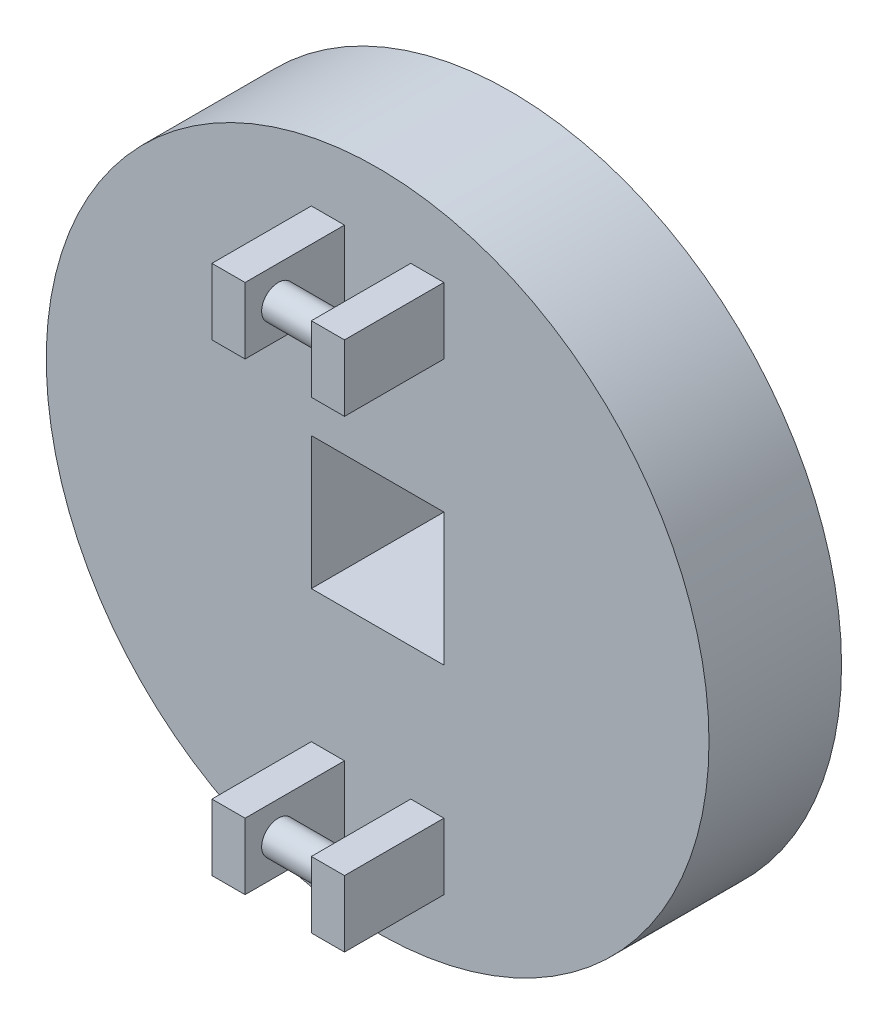
ISO-10303-21;
HEADER;
FILE_DESCRIPTION(('STEP AP214'),'2;1');
FILE_NAME('part.step','',(''),(''),'','','');
FILE_SCHEMA(('AUTOMOTIVE_DESIGN { 1 0 10303 214 1 1 1 1 }'));
ENDSEC;
DATA;
#1=APPLICATION_CONTEXT('core data for automotive mechanical design processes');
#2=APPLICATION_PROTOCOL_DEFINITION('international standard','automotive_design',2000,#1);
#3=PRODUCT_CONTEXT('',#1,'mechanical');
#4=PRODUCT('Part','Part','',(#3));
#5=PRODUCT_RELATED_PRODUCT_CATEGORY('part','',(#4));
#6=PRODUCT_DEFINITION_FORMATION('','',#4);
#7=PRODUCT_DEFINITION_CONTEXT('part definition',#1,'design');
#8=PRODUCT_DEFINITION('design','',#6,#7);
#9=PRODUCT_DEFINITION_SHAPE('','',#8);
#10=(LENGTH_UNIT() NAMED_UNIT(*) SI_UNIT(.MILLI.,.METRE.));
#11=(NAMED_UNIT(*) PLANE_ANGLE_UNIT() SI_UNIT($,.RADIAN.));
#12=(NAMED_UNIT(*) SI_UNIT($,.STERADIAN.) SOLID_ANGLE_UNIT());
#13=UNCERTAINTY_MEASURE_WITH_UNIT(LENGTH_MEASURE(1.E-05),#10,'distance_accuracy_value','');
#14=(GEOMETRIC_REPRESENTATION_CONTEXT(3) GLOBAL_UNCERTAINTY_ASSIGNED_CONTEXT((#13)) GLOBAL_UNIT_ASSIGNED_CONTEXT((#10,
#11,#12)) REPRESENTATION_CONTEXT('',''));
#15=CARTESIAN_POINT('',(0.,0.,0.));
#16=DIRECTION('',(0.,0.,1.));
#17=DIRECTION('',(1.,0.,0.));
#18=AXIS2_PLACEMENT_3D('',#15,#16,#17);
#19=CARTESIAN_POINT('',(0.,0.,12.7));
#20=DIRECTION('',(0.,0.,1.));
#21=DIRECTION('',(1.,0.,0.));
#22=AXIS2_PLACEMENT_3D('',#19,#20,#21);
#23=PLANE('',#22);
#24=DIRECTION('',(0.,-1.,0.));
#25=VECTOR('',#24,1.);
#26=CARTESIAN_POINT('',(-12.7,-12.7,12.7));
#27=LINE('',#26,#25);
#28=CARTESIAN_POINT('',(-12.7,12.7,12.7));
#29=VERTEX_POINT('',#28);
#30=CARTESIAN_POINT('',(-12.7,-12.7,12.7));
#31=VERTEX_POINT('',#30);
#32=EDGE_CURVE('E50',#29,#31,#27,.T.);
#33=ORIENTED_EDGE('',*,*,#32,.F.);
#34=DIRECTION('',(-1.,0.,0.));
#35=VECTOR('',#34,1.);
#36=CARTESIAN_POINT('',(-12.7,12.7,12.7));
#37=LINE('',#36,#35);
#38=CARTESIAN_POINT('',(12.7,12.7,12.7));
#39=VERTEX_POINT('',#38);
#40=EDGE_CURVE('E190',#39,#29,#37,.T.);
#41=ORIENTED_EDGE('',*,*,#40,.F.);
#42=DIRECTION('',(0.,1.,0.));
#43=VECTOR('',#42,1.);
#44=CARTESIAN_POINT('',(12.7,-12.7,12.7));
#45=LINE('',#44,#43);
#46=CARTESIAN_POINT('',(12.7,-12.7,12.7));
#47=VERTEX_POINT('',#46);
#48=EDGE_CURVE('E193',#47,#39,#45,.T.);
#49=ORIENTED_EDGE('',*,*,#48,.F.);
#50=DIRECTION('',(1.,0.,0.));
#51=VECTOR('',#50,1.);
#52=CARTESIAN_POINT('',(-12.7,-12.7,12.7));
#53=LINE('',#52,#51);
#54=EDGE_CURVE('E199',#31,#47,#53,.T.);
#55=ORIENTED_EDGE('',*,*,#54,.F.);
#56=EDGE_LOOP('',(#33,#41,#49,#55));
#57=FACE_BOUND('',#56,.T.);
#58=DIRECTION('',(0.,1.,0.));
#59=VECTOR('',#58,1.);
#60=CARTESIAN_POINT('',(-6.34999999999999,0.,12.7));
#61=LINE('',#60,#59);
#62=CARTESIAN_POINT('',(-6.35,-50.8,12.7));
#63=VERTEX_POINT('',#62);
#64=CARTESIAN_POINT('',(-6.35,-38.1,12.7));
#65=VERTEX_POINT('',#64);
#66=EDGE_CURVE('E258',#63,#65,#61,.T.);
#67=ORIENTED_EDGE('',*,*,#66,.F.);
#68=DIRECTION('',(1.,0.,0.));
#69=VECTOR('',#68,1.);
#70=CARTESIAN_POINT('',(0.,-50.8,12.7));
#71=LINE('',#70,#69);
#72=CARTESIAN_POINT('',(-12.7,-50.8,12.7));
#73=VERTEX_POINT('',#72);
#74=EDGE_CURVE('E243',#73,#63,#71,.T.);
#75=ORIENTED_EDGE('',*,*,#74,.F.);
#76=DIRECTION('',(0.,-1.,0.));
#77=VECTOR('',#76,1.);
#78=CARTESIAN_POINT('',(-12.7,0.,12.7));
#79=LINE('',#78,#77);
#80=CARTESIAN_POINT('',(-12.7,-38.1,12.7));
#81=VERTEX_POINT('',#80);
#82=EDGE_CURVE('E248',#81,#73,#79,.T.);
#83=ORIENTED_EDGE('',*,*,#82,.F.);
#84=DIRECTION('',(1.,0.,0.));
#85=VECTOR('',#84,1.);
#86=CARTESIAN_POINT('',(0.,-38.1,12.7));
#87=LINE('',#86,#85);
#88=EDGE_CURVE('E261',#81,#65,#87,.T.);
#89=ORIENTED_EDGE('',*,*,#88,.T.);
#90=EDGE_LOOP('',(#67,#75,#83,#89));
#91=FACE_BOUND('',#90,.T.);
#92=DIRECTION('',(1.,0.,0.));
#93=VECTOR('',#92,1.);
#94=CARTESIAN_POINT('',(0.,50.8,12.7));
#95=LINE('',#94,#93);
#96=CARTESIAN_POINT('',(6.35,50.8,12.7));
#97=VERTEX_POINT('',#96);
#98=CARTESIAN_POINT('',(12.7,50.8,12.7));
#99=VERTEX_POINT('',#98);
#100=EDGE_CURVE('E277',#97,#99,#95,.T.);
#101=ORIENTED_EDGE('',*,*,#100,.T.);
#102=DIRECTION('',(0.,1.,0.));
#103=VECTOR('',#102,1.);
#104=CARTESIAN_POINT('',(12.7000000000001,0.,12.7));
#105=LINE('',#104,#103);
#106=CARTESIAN_POINT('',(12.7,38.1,12.7));
#107=VERTEX_POINT('',#106);
#108=EDGE_CURVE('E282',#107,#99,#105,.T.);
#109=ORIENTED_EDGE('',*,*,#108,.F.);
#110=DIRECTION('',(1.,0.,0.));
#111=VECTOR('',#110,1.);
#112=CARTESIAN_POINT('',(0.,38.1,12.7));
#113=LINE('',#112,#111);
#114=CARTESIAN_POINT('',(6.35,38.1,12.7));
#115=VERTEX_POINT('',#114);
#116=EDGE_CURVE('E293',#115,#107,#113,.T.);
#117=ORIENTED_EDGE('',*,*,#116,.F.);
#118=DIRECTION('',(0.,-1.,0.));
#119=VECTOR('',#118,1.);
#120=CARTESIAN_POINT('',(6.35000000000001,0.,12.7));
#121=LINE('',#120,#119);
#122=EDGE_CURVE('E291',#97,#115,#121,.T.);
#123=ORIENTED_EDGE('',*,*,#122,.F.);
#124=EDGE_LOOP('',(#101,#109,#117,#123));
#125=FACE_BOUND('',#124,.T.);
#126=DIRECTION('',(1.,0.,0.));
#127=VECTOR('',#126,1.);
#128=CARTESIAN_POINT('',(0.,50.8,12.7));
#129=LINE('',#128,#127);
#130=CARTESIAN_POINT('',(-12.7,50.8,12.7));
#131=VERTEX_POINT('',#130);
#132=CARTESIAN_POINT('',(-6.35,50.8,12.7));
#133=VERTEX_POINT('',#132);
#134=EDGE_CURVE('E306',#131,#133,#129,.T.);
#135=ORIENTED_EDGE('',*,*,#134,.T.);
#136=DIRECTION('',(0.,-1.,0.));
#137=VECTOR('',#136,1.);
#138=CARTESIAN_POINT('',(-6.34999999999999,0.,12.7));
#139=LINE('',#138,#137);
#140=CARTESIAN_POINT('',(-6.35,38.1,12.7));
#141=VERTEX_POINT('',#140);
#142=EDGE_CURVE('E311',#133,#141,#139,.T.);
#143=ORIENTED_EDGE('',*,*,#142,.T.);
#144=DIRECTION('',(1.,0.,0.));
#145=VECTOR('',#144,1.);
#146=CARTESIAN_POINT('',(0.,38.1,12.7));
#147=LINE('',#146,#145);
#148=CARTESIAN_POINT('',(-12.7,38.1,12.7));
#149=VERTEX_POINT('',#148);
#150=EDGE_CURVE('E323',#149,#141,#147,.T.);
#151=ORIENTED_EDGE('',*,*,#150,.F.);
#152=DIRECTION('',(0.,1.,0.));
#153=VECTOR('',#152,1.);
#154=CARTESIAN_POINT('',(-12.7,0.,12.7));
#155=LINE('',#154,#153);
#156=EDGE_CURVE('E321',#149,#131,#155,.T.);
#157=ORIENTED_EDGE('',*,*,#156,.T.);
#158=EDGE_LOOP('',(#135,#143,#151,#157));
#159=FACE_BOUND('',#158,.T.);
#160=CARTESIAN_POINT('',(0.,0.,12.7));
#161=DIRECTION('',(0.,0.,1.));
#162=DIRECTION('',(1.,0.,0.));
#163=AXIS2_PLACEMENT_3D('',#160,#161,#162);
#164=CIRCLE('',#163,63.5);
#165=CARTESIAN_POINT('',(63.5,0.,12.7));
#166=VERTEX_POINT('',#165);
#167=EDGE_CURVE('E339',#166,#166,#164,.T.);
#168=ORIENTED_EDGE('',*,*,#167,.T.);
#169=EDGE_LOOP('',(#168));
#170=FACE_BOUND('',#169,.T.);
#171=DIRECTION('',(0.,-1.,0.));
#172=VECTOR('',#171,1.);
#173=CARTESIAN_POINT('',(12.7000000000001,0.,12.7));
#174=LINE('',#173,#172);
#175=CARTESIAN_POINT('',(12.7,-38.1,12.7));
#176=VERTEX_POINT('',#175);
#177=CARTESIAN_POINT('',(12.7,-50.8,12.7));
#178=VERTEX_POINT('',#177);
#179=EDGE_CURVE('E227',#176,#178,#174,.T.);
#180=ORIENTED_EDGE('',*,*,#179,.T.);
#181=DIRECTION('',(1.,0.,0.));
#182=VECTOR('',#181,1.);
#183=CARTESIAN_POINT('',(0.,-50.8,12.7));
#184=LINE('',#183,#182);
#185=CARTESIAN_POINT('',(6.35,-50.8,12.7));
#186=VERTEX_POINT('',#185);
#187=EDGE_CURVE('E211',#186,#178,#184,.T.);
#188=ORIENTED_EDGE('',*,*,#187,.F.);
#189=DIRECTION('',(0.,1.,0.));
#190=VECTOR('',#189,1.);
#191=CARTESIAN_POINT('',(6.35000000000001,0.,12.7));
#192=LINE('',#191,#190);
#193=CARTESIAN_POINT('',(6.35,-38.1,12.7));
#194=VERTEX_POINT('',#193);
#195=EDGE_CURVE('E215',#186,#194,#192,.T.);
#196=ORIENTED_EDGE('',*,*,#195,.T.);
#197=DIRECTION('',(1.,0.,0.));
#198=VECTOR('',#197,1.);
#199=CARTESIAN_POINT('',(0.,-38.1,12.7));
#200=LINE('',#199,#198);
#201=EDGE_CURVE('E229',#194,#176,#200,.T.);
#202=ORIENTED_EDGE('',*,*,#201,.T.);
#203=EDGE_LOOP('',(#180,#188,#196,#202));
#204=FACE_BOUND('',#203,.T.);
#205=ADVANCED_FACE('F35',(#57,#91,#125,#159,#170,#204),#23,.T.);
#206=CARTESIAN_POINT('',(-6.34999999999999,0.,31.75));
#207=DIRECTION('',(1.,0.,0.));
#208=DIRECTION('',(0.,1.,0.));
#209=AXIS2_PLACEMENT_3D('',#206,#207,#208);
#210=PLANE('',#209);
#211=ORIENTED_EDGE('',*,*,#142,.F.);
#212=DIRECTION('',(0.,0.,-1.));
#213=VECTOR('',#212,1.);
#214=CARTESIAN_POINT('',(-6.35,50.8,31.75));
#215=LINE('',#214,#213);
#216=CARTESIAN_POINT('',(-6.35,50.8,31.75));
#217=VERTEX_POINT('',#216);
#218=EDGE_CURVE('E319',#217,#133,#215,.T.);
#219=ORIENTED_EDGE('',*,*,#218,.F.);
#220=DIRECTION('',(0.,-1.,0.));
#221=VECTOR('',#220,1.);
#222=CARTESIAN_POINT('',(-6.34999999999999,0.,31.75));
#223=LINE('',#222,#221);
#224=CARTESIAN_POINT('',(-6.35,38.1,31.75));
#225=VERTEX_POINT('',#224);
#226=EDGE_CURVE('E316',#217,#225,#223,.T.);
#227=ORIENTED_EDGE('',*,*,#226,.T.);
#228=DIRECTION('',(0.,0.,-1.));
#229=VECTOR('',#228,1.);
#230=CARTESIAN_POINT('',(-6.35,38.1,31.75));
#231=LINE('',#230,#229);
#232=EDGE_CURVE('E329',#225,#141,#231,.T.);
#233=ORIENTED_EDGE('',*,*,#232,.T.);
#234=EDGE_LOOP('',(#211,#219,#227,#233));
#235=FACE_BOUND('',#234,.T.);
#236=CARTESIAN_POINT('',(-6.35,44.45,25.4));
#237=DIRECTION('',(1.,0.,0.));
#238=DIRECTION('',(0.,1.,0.));
#239=AXIS2_PLACEMENT_3D('',#236,#237,#238);
#240=CIRCLE('',#239,3.175);
#241=CARTESIAN_POINT('',(-6.35,47.625,25.4));
#242=VERTEX_POINT('',#241);
#243=EDGE_CURVE('E274',#242,#242,#240,.T.);
#244=ORIENTED_EDGE('',*,*,#243,.F.);
#245=EDGE_LOOP('',(#244));
#246=FACE_BOUND('',#245,.T.);
#247=ADVANCED_FACE('F350',(#235,#246),#210,.T.);
#248=CARTESIAN_POINT('',(6.35000000000001,0.,31.75));
#249=DIRECTION('',(1.,0.,0.));
#250=DIRECTION('',(0.,1.,0.));
#251=AXIS2_PLACEMENT_3D('',#248,#249,#250);
#252=PLANE('',#251);
#253=ORIENTED_EDGE('',*,*,#122,.T.);
#254=DIRECTION('',(0.,0.,-1.));
#255=VECTOR('',#254,1.);
#256=CARTESIAN_POINT('',(6.35,38.1,31.75));
#257=LINE('',#256,#255);
#258=CARTESIAN_POINT('',(6.35,38.1,31.75));
#259=VERTEX_POINT('',#258);
#260=EDGE_CURVE('E301',#259,#115,#257,.T.);
#261=ORIENTED_EDGE('',*,*,#260,.F.);
#262=DIRECTION('',(0.,-1.,0.));
#263=VECTOR('',#262,1.);
#264=CARTESIAN_POINT('',(6.35000000000001,0.,31.75));
#265=LINE('',#264,#263);
#266=CARTESIAN_POINT('',(6.35,50.8,31.75));
#267=VERTEX_POINT('',#266);
#268=EDGE_CURVE('E281',#267,#259,#265,.T.);
#269=ORIENTED_EDGE('',*,*,#268,.F.);
#270=DIRECTION('',(0.,0.,-1.));
#271=VECTOR('',#270,1.);
#272=CARTESIAN_POINT('',(6.35,50.8,31.75));
#273=LINE('',#272,#271);
#274=EDGE_CURVE('E304',#267,#97,#273,.T.);
#275=ORIENTED_EDGE('',*,*,#274,.T.);
#276=EDGE_LOOP('',(#253,#261,#269,#275));
#277=FACE_BOUND('',#276,.T.);
#278=CARTESIAN_POINT('',(6.34999999999764,44.45,25.4));
#279=DIRECTION('',(1.,0.,0.));
#280=DIRECTION('',(0.,1.,0.));
#281=AXIS2_PLACEMENT_3D('',#278,#279,#280);
#282=CIRCLE('',#281,3.175);
#283=CARTESIAN_POINT('',(6.34999999999764,47.625,25.4));
#284=VERTEX_POINT('',#283);
#285=EDGE_CURVE('E43',#284,#284,#282,.F.);
#286=ORIENTED_EDGE('',*,*,#285,.F.);
#287=EDGE_LOOP('',(#286));
#288=FACE_BOUND('',#287,.T.);
#289=ADVANCED_FACE('F348',(#277,#288),#252,.F.);
#290=CARTESIAN_POINT('',(0.,0.,12.7));
#291=DIRECTION('',(0.,0.,-1.));
#292=DIRECTION('',(-1.,0.,0.));
#293=AXIS2_PLACEMENT_3D('',#290,#291,#292);
#294=CYLINDRICAL_SURFACE('',#293,63.5);
#295=ORIENTED_EDGE('',*,*,#167,.F.);
#296=EDGE_LOOP('',(#295));
#297=FACE_BOUND('',#296,.T.);
#298=CARTESIAN_POINT('',(0.,0.,-12.7));
#299=DIRECTION('',(0.,0.,1.));
#300=DIRECTION('',(1.,0.,0.));
#301=AXIS2_PLACEMENT_3D('',#298,#299,#300);
#302=CIRCLE('',#301,63.5);
#303=CARTESIAN_POINT('',(63.5,0.,-12.7));
#304=VERTEX_POINT('',#303);
#305=EDGE_CURVE('E338',#304,#304,#302,.T.);
#306=ORIENTED_EDGE('',*,*,#305,.T.);
#307=EDGE_LOOP('',(#306));
#308=FACE_BOUND('',#307,.T.);
#309=ADVANCED_FACE('F37',(#297,#308),#294,.T.);
#310=CARTESIAN_POINT('',(0.,0.,-12.7));
#311=DIRECTION('',(0.,0.,1.));
#312=DIRECTION('',(1.,0.,0.));
#313=AXIS2_PLACEMENT_3D('',#310,#311,#312);
#314=PLANE('',#313);
#315=DIRECTION('',(-1.,0.,0.));
#316=VECTOR('',#315,1.);
#317=CARTESIAN_POINT('',(-12.7,12.7,-12.7));
#318=LINE('',#317,#316);
#319=CARTESIAN_POINT('',(12.7,12.7,-12.7));
#320=VERTEX_POINT('',#319);
#321=CARTESIAN_POINT('',(-12.7,12.7,-12.7));
#322=VERTEX_POINT('',#321);
#323=EDGE_CURVE('E180',#320,#322,#318,.T.);
#324=ORIENTED_EDGE('',*,*,#323,.T.);
#325=DIRECTION('',(0.,-1.,0.));
#326=VECTOR('',#325,1.);
#327=CARTESIAN_POINT('',(-12.7,-12.7,-12.7));
#328=LINE('',#327,#326);
#329=CARTESIAN_POINT('',(-12.7,-12.7,-12.7));
#330=VERTEX_POINT('',#329);
#331=EDGE_CURVE('E174',#322,#330,#328,.T.);
#332=ORIENTED_EDGE('',*,*,#331,.T.);
#333=DIRECTION('',(1.,0.,0.));
#334=VECTOR('',#333,1.);
#335=CARTESIAN_POINT('',(-12.7,-12.7,-12.7));
#336=LINE('',#335,#334);
#337=CARTESIAN_POINT('',(12.7,-12.7,-12.7));
#338=VERTEX_POINT('',#337);
#339=EDGE_CURVE('E183',#330,#338,#336,.T.);
#340=ORIENTED_EDGE('',*,*,#339,.T.);
#341=DIRECTION('',(0.,1.,0.));
#342=VECTOR('',#341,1.);
#343=CARTESIAN_POINT('',(12.7,-12.7,-12.7));
#344=LINE('',#343,#342);
#345=EDGE_CURVE('E58',#338,#320,#344,.T.);
#346=ORIENTED_EDGE('',*,*,#345,.T.);
#347=EDGE_LOOP('',(#324,#332,#340,#346));
#348=FACE_BOUND('',#347,.T.);
#349=ORIENTED_EDGE('',*,*,#305,.F.);
#350=EDGE_LOOP('',(#349));
#351=FACE_BOUND('',#350,.T.);
#352=ADVANCED_FACE('F187',(#348,#351),#314,.F.);
#353=CARTESIAN_POINT('',(0.,50.8,31.75));
#354=DIRECTION('',(0.,1.,0.));
#355=DIRECTION('',(0.,0.,1.));
#356=AXIS2_PLACEMENT_3D('',#353,#354,#355);
#357=PLANE('',#356);
#358=ORIENTED_EDGE('',*,*,#134,.F.);
#359=DIRECTION('',(0.,0.,-1.));
#360=VECTOR('',#359,1.);
#361=CARTESIAN_POINT('',(-12.7,50.8,31.75));
#362=LINE('',#361,#360);
#363=CARTESIAN_POINT('',(-12.7,50.8,31.75));
#364=VERTEX_POINT('',#363);
#365=EDGE_CURVE('E335',#364,#131,#362,.T.);
#366=ORIENTED_EDGE('',*,*,#365,.F.);
#367=DIRECTION('',(1.,0.,0.));
#368=VECTOR('',#367,1.);
#369=CARTESIAN_POINT('',(0.,50.8,31.75));
#370=LINE('',#369,#368);
#371=EDGE_CURVE('E307',#364,#217,#370,.T.);
#372=ORIENTED_EDGE('',*,*,#371,.T.);
#373=ORIENTED_EDGE('',*,*,#218,.T.);
#374=EDGE_LOOP('',(#358,#366,#372,#373));
#375=FACE_BOUND('',#374,.T.);
#376=ADVANCED_FACE('F371',(#375),#357,.T.);
#377=CARTESIAN_POINT('',(-12.7,0.,31.75));
#378=DIRECTION('',(-1.,0.,0.));
#379=DIRECTION('',(0.,-1.,0.));
#380=AXIS2_PLACEMENT_3D('',#377,#378,#379);
#381=PLANE('',#380);
#382=ORIENTED_EDGE('',*,*,#156,.F.);
#383=DIRECTION('',(0.,0.,-1.));
#384=VECTOR('',#383,1.);
#385=CARTESIAN_POINT('',(-12.7,38.1,31.75));
#386=LINE('',#385,#384);
#387=CARTESIAN_POINT('',(-12.7,38.1,31.75));
#388=VERTEX_POINT('',#387);
#389=EDGE_CURVE('E332',#388,#149,#386,.T.);
#390=ORIENTED_EDGE('',*,*,#389,.F.);
#391=DIRECTION('',(0.,1.,0.));
#392=VECTOR('',#391,1.);
#393=CARTESIAN_POINT('',(-12.7,0.,31.75));
#394=LINE('',#393,#392);
#395=EDGE_CURVE('E310',#388,#364,#394,.T.);
#396=ORIENTED_EDGE('',*,*,#395,.T.);
#397=ORIENTED_EDGE('',*,*,#365,.T.);
#398=EDGE_LOOP('',(#382,#390,#396,#397));
#399=FACE_BOUND('',#398,.T.);
#400=ADVANCED_FACE('F377',(#399),#381,.T.);
#401=CARTESIAN_POINT('',(0.,38.1,31.75));
#402=DIRECTION('',(0.,1.,0.));
#403=DIRECTION('',(0.,0.,1.));
#404=AXIS2_PLACEMENT_3D('',#401,#402,#403);
#405=PLANE('',#404);
#406=ORIENTED_EDGE('',*,*,#150,.T.);
#407=ORIENTED_EDGE('',*,*,#232,.F.);
#408=DIRECTION('',(1.,0.,0.));
#409=VECTOR('',#408,1.);
#410=CARTESIAN_POINT('',(0.,38.1,31.75));
#411=LINE('',#410,#409);
#412=EDGE_CURVE('E314',#388,#225,#411,.T.);
#413=ORIENTED_EDGE('',*,*,#412,.F.);
#414=ORIENTED_EDGE('',*,*,#389,.T.);
#415=EDGE_LOOP('',(#406,#407,#413,#414));
#416=FACE_BOUND('',#415,.T.);
#417=ADVANCED_FACE('F382',(#416),#405,.F.);
#418=CARTESIAN_POINT('',(0.,0.,31.75));
#419=DIRECTION('',(0.,0.,1.));
#420=DIRECTION('',(1.,0.,0.));
#421=AXIS2_PLACEMENT_3D('',#418,#419,#420);
#422=PLANE('',#421);
#423=ORIENTED_EDGE('',*,*,#371,.F.);
#424=ORIENTED_EDGE('',*,*,#395,.F.);
#425=ORIENTED_EDGE('',*,*,#412,.T.);
#426=ORIENTED_EDGE('',*,*,#226,.F.);
#427=EDGE_LOOP('',(#423,#424,#425,#426));
#428=FACE_BOUND('',#427,.T.);
#429=ADVANCED_FACE('F393',(#428),#422,.T.);
#430=CARTESIAN_POINT('',(0.,50.8,31.75));
#431=DIRECTION('',(0.,1.,0.));
#432=DIRECTION('',(0.,0.,1.));
#433=AXIS2_PLACEMENT_3D('',#430,#431,#432);
#434=PLANE('',#433);
#435=ORIENTED_EDGE('',*,*,#100,.F.);
#436=ORIENTED_EDGE('',*,*,#274,.F.);
#437=DIRECTION('',(1.,0.,0.));
#438=VECTOR('',#437,1.);
#439=CARTESIAN_POINT('',(0.,50.8,31.75));
#440=LINE('',#439,#438);
#441=CARTESIAN_POINT('',(12.7,50.8,31.75));
#442=VERTEX_POINT('',#441);
#443=EDGE_CURVE('E278',#267,#442,#440,.T.);
#444=ORIENTED_EDGE('',*,*,#443,.T.);
#445=DIRECTION('',(0.,0.,-1.));
#446=VECTOR('',#445,1.);
#447=CARTESIAN_POINT('',(12.7,50.8,31.75));
#448=LINE('',#447,#446);
#449=EDGE_CURVE('E288',#442,#99,#448,.T.);
#450=ORIENTED_EDGE('',*,*,#449,.T.);
#451=EDGE_LOOP('',(#435,#436,#444,#450));
#452=FACE_BOUND('',#451,.T.);
#453=ADVANCED_FACE('F403',(#452),#434,.T.);
#454=CARTESIAN_POINT('',(0.,38.1,31.75));
#455=DIRECTION('',(0.,1.,0.));
#456=DIRECTION('',(0.,0.,1.));
#457=AXIS2_PLACEMENT_3D('',#454,#455,#456);
#458=PLANE('',#457);
#459=ORIENTED_EDGE('',*,*,#116,.T.);
#460=DIRECTION('',(0.,0.,-1.));
#461=VECTOR('',#460,1.);
#462=CARTESIAN_POINT('',(12.7,38.1,31.75));
#463=LINE('',#462,#461);
#464=CARTESIAN_POINT('',(12.7,38.1,31.75));
#465=VERTEX_POINT('',#464);
#466=EDGE_CURVE('E299',#465,#107,#463,.T.);
#467=ORIENTED_EDGE('',*,*,#466,.F.);
#468=DIRECTION('',(1.,0.,0.));
#469=VECTOR('',#468,1.);
#470=CARTESIAN_POINT('',(0.,38.1,31.75));
#471=LINE('',#470,#469);
#472=EDGE_CURVE('E284',#259,#465,#471,.T.);
#473=ORIENTED_EDGE('',*,*,#472,.F.);
#474=ORIENTED_EDGE('',*,*,#260,.T.);
#475=EDGE_LOOP('',(#459,#467,#473,#474));
#476=FACE_BOUND('',#475,.T.);
#477=ADVANCED_FACE('F406',(#476),#458,.F.);
#478=CARTESIAN_POINT('',(12.7000000000001,0.,31.75));
#479=DIRECTION('',(-1.,0.,0.));
#480=DIRECTION('',(0.,-1.,0.));
#481=AXIS2_PLACEMENT_3D('',#478,#479,#480);
#482=PLANE('',#481);
#483=ORIENTED_EDGE('',*,*,#108,.T.);
#484=ORIENTED_EDGE('',*,*,#449,.F.);
#485=DIRECTION('',(0.,1.,0.));
#486=VECTOR('',#485,1.);
#487=CARTESIAN_POINT('',(12.7000000000001,0.,31.75));
#488=LINE('',#487,#486);
#489=EDGE_CURVE('E286',#465,#442,#488,.T.);
#490=ORIENTED_EDGE('',*,*,#489,.F.);
#491=ORIENTED_EDGE('',*,*,#466,.T.);
#492=EDGE_LOOP('',(#483,#484,#490,#491));
#493=FACE_BOUND('',#492,.T.);
#494=ADVANCED_FACE('F411',(#493),#482,.F.);
#495=CARTESIAN_POINT('',(0.,0.,31.75));
#496=DIRECTION('',(0.,0.,1.));
#497=DIRECTION('',(1.,0.,0.));
#498=AXIS2_PLACEMENT_3D('',#495,#496,#497);
#499=PLANE('',#498);
#500=ORIENTED_EDGE('',*,*,#443,.F.);
#501=ORIENTED_EDGE('',*,*,#268,.T.);
#502=ORIENTED_EDGE('',*,*,#472,.T.);
#503=ORIENTED_EDGE('',*,*,#489,.T.);
#504=EDGE_LOOP('',(#500,#501,#502,#503));
#505=FACE_BOUND('',#504,.T.);
#506=ADVANCED_FACE('F426',(#505),#499,.T.);
#507=CARTESIAN_POINT('',(500000.,44.4500000000683,25.4));
#508=DIRECTION('',(-1.,0.,0.));
#509=DIRECTION('',(0.,-1.,0.));
#510=AXIS2_PLACEMENT_3D('',#507,#508,#509);
#511=CYLINDRICAL_SURFACE('',#510,3.175);
#512=ORIENTED_EDGE('',*,*,#243,.T.);
#513=EDGE_LOOP('',(#512));
#514=FACE_BOUND('',#513,.T.);
#515=ORIENTED_EDGE('',*,*,#285,.T.);
#516=EDGE_LOOP('',(#515));
#517=FACE_BOUND('',#516,.T.);
#518=ADVANCED_FACE('F346',(#514,#517),#511,.T.);
#519=CARTESIAN_POINT('',(0.,-50.8,31.75));
#520=DIRECTION('',(0.,1.,0.));
#521=DIRECTION('',(0.,0.,1.));
#522=AXIS2_PLACEMENT_3D('',#519,#520,#521);
#523=PLANE('',#522);
#524=ORIENTED_EDGE('',*,*,#74,.T.);
#525=DIRECTION('',(0.,0.,-1.));
#526=VECTOR('',#525,1.);
#527=CARTESIAN_POINT('',(-6.35,-50.8,31.75));
#528=LINE('',#527,#526);
#529=CARTESIAN_POINT('',(-6.35,-50.8,31.75));
#530=VERTEX_POINT('',#529);
#531=EDGE_CURVE('E272',#530,#63,#528,.T.);
#532=ORIENTED_EDGE('',*,*,#531,.F.);
#533=DIRECTION('',(1.,0.,0.));
#534=VECTOR('',#533,1.);
#535=CARTESIAN_POINT('',(0.,-50.8,31.75));
#536=LINE('',#535,#534);
#537=CARTESIAN_POINT('',(-12.7,-50.8,31.75));
#538=VERTEX_POINT('',#537);
#539=EDGE_CURVE('E244',#538,#530,#536,.T.);
#540=ORIENTED_EDGE('',*,*,#539,.F.);
#541=DIRECTION('',(0.,0.,-1.));
#542=VECTOR('',#541,1.);
#543=CARTESIAN_POINT('',(-12.7,-50.8,31.75));
#544=LINE('',#543,#542);
#545=EDGE_CURVE('E255',#538,#73,#544,.T.);
#546=ORIENTED_EDGE('',*,*,#545,.T.);
#547=EDGE_LOOP('',(#524,#532,#540,#546));
#548=FACE_BOUND('',#547,.T.);
#549=ADVANCED_FACE('F437',(#548),#523,.F.);
#550=CARTESIAN_POINT('',(-6.34999999999999,0.,31.75));
#551=DIRECTION('',(-1.,0.,0.));
#552=DIRECTION('',(0.,-1.,0.));
#553=AXIS2_PLACEMENT_3D('',#550,#551,#552);
#554=PLANE('',#553);
#555=CARTESIAN_POINT('',(-6.35,-44.45,25.4));
#556=DIRECTION('',(-1.,0.,0.));
#557=DIRECTION('',(0.,-1.,0.));
#558=AXIS2_PLACEMENT_3D('',#555,#556,#557);
#559=CIRCLE('',#558,3.175);
#560=CARTESIAN_POINT('',(-6.35,-47.625,25.4));
#561=VERTEX_POINT('',#560);
#562=EDGE_CURVE('E205',#561,#561,#559,.T.);
#563=ORIENTED_EDGE('',*,*,#562,.T.);
#564=EDGE_LOOP('',(#563));
#565=FACE_BOUND('',#564,.T.);
#566=ORIENTED_EDGE('',*,*,#66,.T.);
#567=DIRECTION('',(0.,0.,-1.));
#568=VECTOR('',#567,1.);
#569=CARTESIAN_POINT('',(-6.35,-38.1,31.75));
#570=LINE('',#569,#568);
#571=CARTESIAN_POINT('',(-6.35,-38.1,31.75));
#572=VERTEX_POINT('',#571);
#573=EDGE_CURVE('E270',#572,#65,#570,.T.);
#574=ORIENTED_EDGE('',*,*,#573,.F.);
#575=DIRECTION('',(0.,1.,0.));
#576=VECTOR('',#575,1.);
#577=CARTESIAN_POINT('',(-6.34999999999999,0.,31.75));
#578=LINE('',#577,#576);
#579=EDGE_CURVE('E247',#530,#572,#578,.T.);
#580=ORIENTED_EDGE('',*,*,#579,.F.);
#581=ORIENTED_EDGE('',*,*,#531,.T.);
#582=EDGE_LOOP('',(#566,#574,#580,#581));
#583=FACE_BOUND('',#582,.T.);
#584=ADVANCED_FACE('F441',(#565,#583),#554,.F.);
#585=CARTESIAN_POINT('',(0.,-38.1,31.75));
#586=DIRECTION('',(0.,1.,0.));
#587=DIRECTION('',(0.,0.,1.));
#588=AXIS2_PLACEMENT_3D('',#585,#586,#587);
#589=PLANE('',#588);
#590=ORIENTED_EDGE('',*,*,#88,.F.);
#591=DIRECTION('',(0.,0.,-1.));
#592=VECTOR('',#591,1.);
#593=CARTESIAN_POINT('',(-12.7,-38.1,31.75));
#594=LINE('',#593,#592);
#595=CARTESIAN_POINT('',(-12.7,-38.1,31.75));
#596=VERTEX_POINT('',#595);
#597=EDGE_CURVE('E267',#596,#81,#594,.T.);
#598=ORIENTED_EDGE('',*,*,#597,.F.);
#599=DIRECTION('',(1.,0.,0.));
#600=VECTOR('',#599,1.);
#601=CARTESIAN_POINT('',(0.,-38.1,31.75));
#602=LINE('',#601,#600);
#603=EDGE_CURVE('E250',#596,#572,#602,.T.);
#604=ORIENTED_EDGE('',*,*,#603,.T.);
#605=ORIENTED_EDGE('',*,*,#573,.T.);
#606=EDGE_LOOP('',(#590,#598,#604,#605));
#607=FACE_BOUND('',#606,.T.);
#608=ADVANCED_FACE('F445',(#607),#589,.T.);
#609=CARTESIAN_POINT('',(-12.7,0.,31.75));
#610=DIRECTION('',(1.,0.,0.));
#611=DIRECTION('',(0.,1.,0.));
#612=AXIS2_PLACEMENT_3D('',#609,#610,#611);
#613=PLANE('',#612);
#614=ORIENTED_EDGE('',*,*,#82,.T.);
#615=ORIENTED_EDGE('',*,*,#545,.F.);
#616=DIRECTION('',(0.,-1.,0.));
#617=VECTOR('',#616,1.);
#618=CARTESIAN_POINT('',(-12.7,0.,31.75));
#619=LINE('',#618,#617);
#620=EDGE_CURVE('E253',#596,#538,#619,.T.);
#621=ORIENTED_EDGE('',*,*,#620,.F.);
#622=ORIENTED_EDGE('',*,*,#597,.T.);
#623=EDGE_LOOP('',(#614,#615,#621,#622));
#624=FACE_BOUND('',#623,.T.);
#625=ADVANCED_FACE('F449',(#624),#613,.F.);
#626=CARTESIAN_POINT('',(0.,0.,31.75));
#627=DIRECTION('',(0.,0.,1.));
#628=DIRECTION('',(1.,0.,0.));
#629=AXIS2_PLACEMENT_3D('',#626,#627,#628);
#630=PLANE('',#629);
#631=ORIENTED_EDGE('',*,*,#539,.T.);
#632=ORIENTED_EDGE('',*,*,#579,.T.);
#633=ORIENTED_EDGE('',*,*,#603,.F.);
#634=ORIENTED_EDGE('',*,*,#620,.T.);
#635=EDGE_LOOP('',(#631,#632,#633,#634));
#636=FACE_BOUND('',#635,.T.);
#637=ADVANCED_FACE('F453',(#636),#630,.T.);
#638=CARTESIAN_POINT('',(0.,-50.8,31.75));
#639=DIRECTION('',(0.,1.,0.));
#640=DIRECTION('',(0.,0.,1.));
#641=AXIS2_PLACEMENT_3D('',#638,#639,#640);
#642=PLANE('',#641);
#643=ORIENTED_EDGE('',*,*,#187,.T.);
#644=DIRECTION('',(0.,0.,-1.));
#645=VECTOR('',#644,1.);
#646=CARTESIAN_POINT('',(12.7,-50.8,31.75));
#647=LINE('',#646,#645);
#648=CARTESIAN_POINT('',(12.7,-50.8,31.75));
#649=VERTEX_POINT('',#648);
#650=EDGE_CURVE('E240',#649,#178,#647,.T.);
#651=ORIENTED_EDGE('',*,*,#650,.F.);
#652=DIRECTION('',(1.,0.,0.));
#653=VECTOR('',#652,1.);
#654=CARTESIAN_POINT('',(0.,-50.8,31.75));
#655=LINE('',#654,#653);
#656=CARTESIAN_POINT('',(6.35,-50.8,31.75));
#657=VERTEX_POINT('',#656);
#658=EDGE_CURVE('E212',#657,#649,#655,.T.);
#659=ORIENTED_EDGE('',*,*,#658,.F.);
#660=DIRECTION('',(0.,0.,-1.));
#661=VECTOR('',#660,1.);
#662=CARTESIAN_POINT('',(6.35,-50.8,31.75));
#663=LINE('',#662,#661);
#664=EDGE_CURVE('E224',#657,#186,#663,.T.);
#665=ORIENTED_EDGE('',*,*,#664,.T.);
#666=EDGE_LOOP('',(#643,#651,#659,#665));
#667=FACE_BOUND('',#666,.T.);
#668=ADVANCED_FACE('F457',(#667),#642,.F.);
#669=CARTESIAN_POINT('',(12.7000000000001,0.,31.75));
#670=DIRECTION('',(1.,0.,0.));
#671=DIRECTION('',(0.,1.,0.));
#672=AXIS2_PLACEMENT_3D('',#669,#670,#671);
#673=PLANE('',#672);
#674=ORIENTED_EDGE('',*,*,#179,.F.);
#675=DIRECTION('',(0.,0.,-1.));
#676=VECTOR('',#675,1.);
#677=CARTESIAN_POINT('',(12.7,-38.1,31.75));
#678=LINE('',#677,#676);
#679=CARTESIAN_POINT('',(12.7,-38.1,31.75));
#680=VERTEX_POINT('',#679);
#681=EDGE_CURVE('E237',#680,#176,#678,.T.);
#682=ORIENTED_EDGE('',*,*,#681,.F.);
#683=DIRECTION('',(0.,-1.,0.));
#684=VECTOR('',#683,1.);
#685=CARTESIAN_POINT('',(12.7000000000001,0.,31.75));
#686=LINE('',#685,#684);
#687=EDGE_CURVE('E214',#680,#649,#686,.T.);
#688=ORIENTED_EDGE('',*,*,#687,.T.);
#689=ORIENTED_EDGE('',*,*,#650,.T.);
#690=EDGE_LOOP('',(#674,#682,#688,#689));
#691=FACE_BOUND('',#690,.T.);
#692=ADVANCED_FACE('F461',(#691),#673,.T.);
#693=CARTESIAN_POINT('',(0.,-38.1,31.75));
#694=DIRECTION('',(0.,1.,0.));
#695=DIRECTION('',(0.,0.,1.));
#696=AXIS2_PLACEMENT_3D('',#693,#694,#695);
#697=PLANE('',#696);
#698=ORIENTED_EDGE('',*,*,#201,.F.);
#699=DIRECTION('',(0.,0.,-1.));
#700=VECTOR('',#699,1.);
#701=CARTESIAN_POINT('',(6.35,-38.1,31.75));
#702=LINE('',#701,#700);
#703=CARTESIAN_POINT('',(6.35,-38.1,31.75));
#704=VERTEX_POINT('',#703);
#705=EDGE_CURVE('E234',#704,#194,#702,.T.);
#706=ORIENTED_EDGE('',*,*,#705,.F.);
#707=DIRECTION('',(1.,0.,0.));
#708=VECTOR('',#707,1.);
#709=CARTESIAN_POINT('',(0.,-38.1,31.75));
#710=LINE('',#709,#708);
#711=EDGE_CURVE('E218',#704,#680,#710,.T.);
#712=ORIENTED_EDGE('',*,*,#711,.T.);
#713=ORIENTED_EDGE('',*,*,#681,.T.);
#714=EDGE_LOOP('',(#698,#706,#712,#713));
#715=FACE_BOUND('',#714,.T.);
#716=ADVANCED_FACE('F465',(#715),#697,.T.);
#717=CARTESIAN_POINT('',(6.35000000000001,0.,31.75));
#718=DIRECTION('',(-1.,0.,0.));
#719=DIRECTION('',(0.,-1.,0.));
#720=AXIS2_PLACEMENT_3D('',#717,#718,#719);
#721=PLANE('',#720);
#722=CARTESIAN_POINT('',(6.34999999999764,-44.45,25.4));
#723=DIRECTION('',(-1.,0.,0.));
#724=DIRECTION('',(0.,-1.,0.));
#725=AXIS2_PLACEMENT_3D('',#722,#723,#724);
#726=CIRCLE('',#725,3.175);
#727=CARTESIAN_POINT('',(6.34999999999764,-47.625,25.4));
#728=VERTEX_POINT('',#727);
#729=EDGE_CURVE('E11',#728,#728,#726,.T.);
#730=ORIENTED_EDGE('',*,*,#729,.F.);
#731=EDGE_LOOP('',(#730));
#732=FACE_BOUND('',#731,.T.);
#733=ORIENTED_EDGE('',*,*,#195,.F.);
#734=ORIENTED_EDGE('',*,*,#664,.F.);
#735=DIRECTION('',(0.,1.,0.));
#736=VECTOR('',#735,1.);
#737=CARTESIAN_POINT('',(6.35000000000001,0.,31.75));
#738=LINE('',#737,#736);
#739=EDGE_CURVE('E221',#657,#704,#738,.T.);
#740=ORIENTED_EDGE('',*,*,#739,.T.);
#741=ORIENTED_EDGE('',*,*,#705,.T.);
#742=EDGE_LOOP('',(#733,#734,#740,#741));
#743=FACE_BOUND('',#742,.T.);
#744=ADVANCED_FACE('F469',(#732,#743),#721,.T.);
#745=CARTESIAN_POINT('',(0.,0.,31.75));
#746=DIRECTION('',(0.,0.,1.));
#747=DIRECTION('',(1.,0.,0.));
#748=AXIS2_PLACEMENT_3D('',#745,#746,#747);
#749=PLANE('',#748);
#750=ORIENTED_EDGE('',*,*,#658,.T.);
#751=ORIENTED_EDGE('',*,*,#687,.F.);
#752=ORIENTED_EDGE('',*,*,#711,.F.);
#753=ORIENTED_EDGE('',*,*,#739,.F.);
#754=EDGE_LOOP('',(#750,#751,#752,#753));
#755=FACE_BOUND('',#754,.T.);
#756=ADVANCED_FACE('F473',(#755),#749,.T.);
#757=CARTESIAN_POINT('',(500000.,-44.4500000000683,25.4));
#758=DIRECTION('',(-1.,0.,0.));
#759=DIRECTION('',(0.,-1.,0.));
#760=AXIS2_PLACEMENT_3D('',#757,#758,#759);
#761=CYLINDRICAL_SURFACE('',#760,3.175);
#762=ORIENTED_EDGE('',*,*,#729,.T.);
#763=EDGE_LOOP('',(#762));
#764=FACE_BOUND('',#763,.T.);
#765=ORIENTED_EDGE('',*,*,#562,.F.);
#766=EDGE_LOOP('',(#765));
#767=FACE_BOUND('',#766,.T.);
#768=ADVANCED_FACE('F477',(#764,#767),#761,.T.);
#769=CARTESIAN_POINT('',(-12.7,-12.7,-12.7));
#770=DIRECTION('',(-1.,0.,0.));
#771=DIRECTION('',(0.,-1.,0.));
#772=AXIS2_PLACEMENT_3D('',#769,#770,#771);
#773=PLANE('',#772);
#774=ORIENTED_EDGE('',*,*,#32,.T.);
#775=DIRECTION('',(0.,0.,1.));
#776=VECTOR('',#775,1.);
#777=CARTESIAN_POINT('',(-12.7,-12.7,-12.7));
#778=LINE('',#777,#776);
#779=EDGE_CURVE('E170',#330,#31,#778,.T.);
#780=ORIENTED_EDGE('',*,*,#779,.F.);
#781=ORIENTED_EDGE('',*,*,#331,.F.);
#782=DIRECTION('',(0.,0.,1.));
#783=VECTOR('',#782,1.);
#784=CARTESIAN_POINT('',(-12.7,12.7,-12.7));
#785=LINE('',#784,#783);
#786=EDGE_CURVE('E203',#322,#29,#785,.T.);
#787=ORIENTED_EDGE('',*,*,#786,.T.);
#788=EDGE_LOOP('',(#774,#780,#781,#787));
#789=FACE_BOUND('',#788,.T.);
#790=ADVANCED_FACE('F172',(#789),#773,.F.);
#791=CARTESIAN_POINT('',(-12.7,12.7,-12.7));
#792=DIRECTION('',(0.,1.,0.));
#793=DIRECTION('',(-1.,0.,0.));
#794=AXIS2_PLACEMENT_3D('',#791,#792,#793);
#795=PLANE('',#794);
#796=ORIENTED_EDGE('',*,*,#40,.T.);
#797=ORIENTED_EDGE('',*,*,#786,.F.);
#798=ORIENTED_EDGE('',*,*,#323,.F.);
#799=DIRECTION('',(0.,0.,1.));
#800=VECTOR('',#799,1.);
#801=CARTESIAN_POINT('',(12.7,12.7,-12.7));
#802=LINE('',#801,#800);
#803=EDGE_CURVE('E206',#320,#39,#802,.T.);
#804=ORIENTED_EDGE('',*,*,#803,.T.);
#805=EDGE_LOOP('',(#796,#797,#798,#804));
#806=FACE_BOUND('',#805,.T.);
#807=ADVANCED_FACE('F484',(#806),#795,.F.);
#808=CARTESIAN_POINT('',(12.7,-12.7,-12.7));
#809=DIRECTION('',(1.,0.,0.));
#810=DIRECTION('',(0.,1.,0.));
#811=AXIS2_PLACEMENT_3D('',#808,#809,#810);
#812=PLANE('',#811);
#813=ORIENTED_EDGE('',*,*,#48,.T.);
#814=ORIENTED_EDGE('',*,*,#803,.F.);
#815=ORIENTED_EDGE('',*,*,#345,.F.);
#816=DIRECTION('',(0.,0.,1.));
#817=VECTOR('',#816,1.);
#818=CARTESIAN_POINT('',(12.7,-12.7,-12.7));
#819=LINE('',#818,#817);
#820=EDGE_CURVE('E179',#338,#47,#819,.T.);
#821=ORIENTED_EDGE('',*,*,#820,.T.);
#822=EDGE_LOOP('',(#813,#814,#815,#821));
#823=FACE_BOUND('',#822,.T.);
#824=ADVANCED_FACE('F487',(#823),#812,.F.);
#825=CARTESIAN_POINT('',(-12.7,-12.7,-12.7));
#826=DIRECTION('',(0.,-1.,0.));
#827=DIRECTION('',(0.,0.,-1.));
#828=AXIS2_PLACEMENT_3D('',#825,#826,#827);
#829=PLANE('',#828);
#830=ORIENTED_EDGE('',*,*,#54,.T.);
#831=ORIENTED_EDGE('',*,*,#820,.F.);
#832=ORIENTED_EDGE('',*,*,#339,.F.);
#833=ORIENTED_EDGE('',*,*,#779,.T.);
#834=EDGE_LOOP('',(#830,#831,#832,#833));
#835=FACE_BOUND('',#834,.T.);
#836=ADVANCED_FACE('F184',(#835),#829,.F.);
#837=CLOSED_SHELL('',(#205,#247,#289,#309,#352,#376,#400,#417,#429,#453,#477,#494,#506,#518,
#549,#584,#608,#625,#637,#668,#692,#716,#744,#756,#768,#790,#807,#824,#836));
#838=MANIFOLD_SOLID_BREP('B2',#837);
#839=ADVANCED_BREP_SHAPE_REPRESENTATION('',(#18,#838),#14);
#840=SHAPE_DEFINITION_REPRESENTATION(#9,#839);
ENDSEC;
END-ISO-10303-21;
